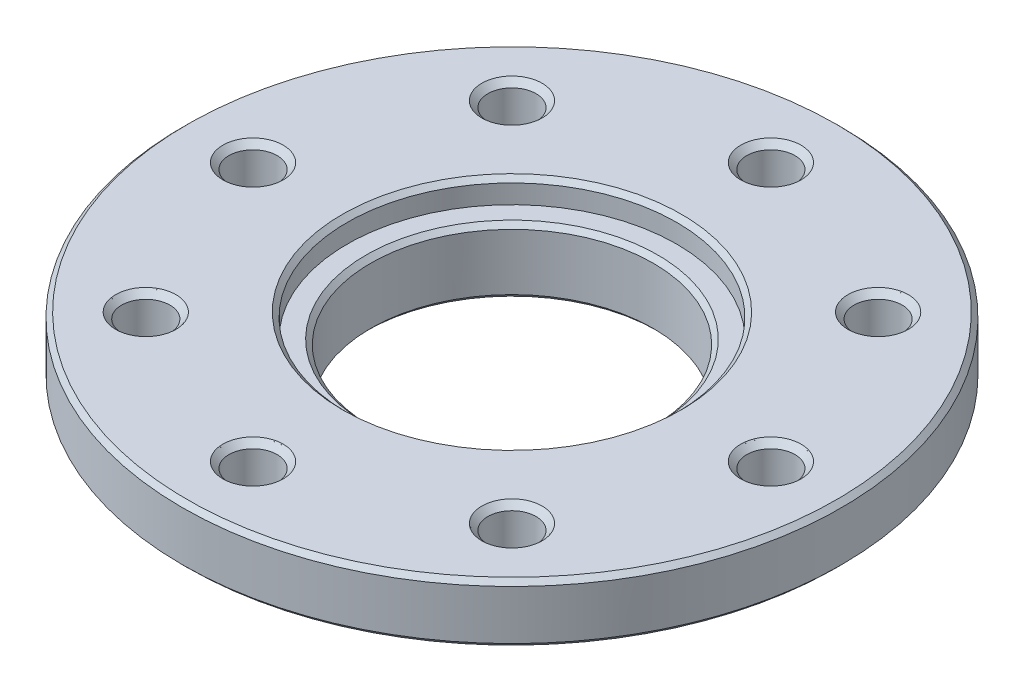
ISO-10303-21;
HEADER;
FILE_DESCRIPTION(('STEP AP214'),'2;1');
FILE_NAME('part.step','',(''),(''),'','','');
FILE_SCHEMA(('AUTOMOTIVE_DESIGN { 1 0 10303 214 1 1 1 1 }'));
ENDSEC;
DATA;
#1=APPLICATION_CONTEXT('core data for automotive mechanical design processes');
#2=APPLICATION_PROTOCOL_DEFINITION('international standard','automotive_design',2000,#1);
#3=PRODUCT_CONTEXT('',#1,'mechanical');
#4=PRODUCT('Part','Part','',(#3));
#5=PRODUCT_RELATED_PRODUCT_CATEGORY('part','',(#4));
#6=PRODUCT_DEFINITION_FORMATION('','',#4);
#7=PRODUCT_DEFINITION_CONTEXT('part definition',#1,'design');
#8=PRODUCT_DEFINITION('design','',#6,#7);
#9=PRODUCT_DEFINITION_SHAPE('','',#8);
#10=(LENGTH_UNIT() NAMED_UNIT(*) SI_UNIT(.MILLI.,.METRE.));
#11=(NAMED_UNIT(*) PLANE_ANGLE_UNIT() SI_UNIT($,.RADIAN.));
#12=(NAMED_UNIT(*) SI_UNIT($,.STERADIAN.) SOLID_ANGLE_UNIT());
#13=UNCERTAINTY_MEASURE_WITH_UNIT(LENGTH_MEASURE(1.E-05),#10,'distance_accuracy_value','');
#14=(GEOMETRIC_REPRESENTATION_CONTEXT(3) GLOBAL_UNCERTAINTY_ASSIGNED_CONTEXT((#13)) GLOBAL_UNIT_ASSIGNED_CONTEXT((#10,
#11,#12)) REPRESENTATION_CONTEXT('',''));
#15=CARTESIAN_POINT('',(0.,0.,0.));
#16=DIRECTION('',(0.,0.,1.));
#17=DIRECTION('',(1.,0.,0.));
#18=AXIS2_PLACEMENT_3D('',#15,#16,#17);
#19=CARTESIAN_POINT('',(7.778174593052,-4.389,7.778174593052));
#20=DIRECTION('',(0.,1.,0.));
#21=DIRECTION('',(0.,0.,1.));
#22=AXIS2_PLACEMENT_3D('',#19,#20,#21);
#23=CYLINDRICAL_SURFACE('',#22,1.25);
#24=CARTESIAN_POINT('',(7.778174593052,-0.03125,7.778174593052));
#25=DIRECTION('',(0.,1.,0.));
#26=DIRECTION('',(0.,0.,1.));
#27=AXIS2_PLACEMENT_3D('',#24,#25,#26);
#28=CIRCLE('',#27,1.25);
#29=CARTESIAN_POINT('',(7.778174593052,-0.03125,9.028174593052));
#30=VERTEX_POINT('',#29);
#31=EDGE_CURVE('P0_E10',#30,#30,#28,.F.);
#32=ORIENTED_EDGE('',*,*,#31,.T.);
#33=EDGE_LOOP('',(#32));
#34=FACE_BOUND('',#33,.T.);
#35=CARTESIAN_POINT('',(7.778174593052,-2.5,7.778174593052));
#36=DIRECTION('',(0.,1.,0.));
#37=DIRECTION('',(0.,0.,1.));
#38=AXIS2_PLACEMENT_3D('',#35,#36,#37);
#39=CIRCLE('',#38,1.25);
#40=CARTESIAN_POINT('',(7.778174593052,-2.5,9.028174593052));
#41=VERTEX_POINT('',#40);
#42=EDGE_CURVE('P0_E16',#41,#41,#39,.T.);
#43=ORIENTED_EDGE('',*,*,#42,.T.);
#44=EDGE_LOOP('',(#43));
#45=FACE_BOUND('',#44,.T.);
#46=ADVANCED_FACE('P0_F15',(#34,#45),#23,.T.);
#47=OPEN_SHELL('',(#46));
#48=SHELL_BASED_SURFACE_MODEL('P0_B1',(#47));
#49=CARTESIAN_POINT('',(0.,-1.00000000009004,0.));
#50=DIRECTION('',(0.,1.,0.));
#51=DIRECTION('',(0.,0.,1.));
#52=AXIS2_PLACEMENT_3D('',#49,#50,#51);
#53=CONICAL_SURFACE('',#52,6.1999999999216,0.785398163397448);
#54=CARTESIAN_POINT('',(0.,-0.999999999976353,0.));
#55=DIRECTION('',(0.,1.,0.));
#56=DIRECTION('',(0.,0.,1.));
#57=AXIS2_PLACEMENT_3D('',#54,#55,#56);
#58=CIRCLE('',#57,6.20000000003529);
#59=CARTESIAN_POINT('',(0.,-0.999999999976353,6.20000000003529));
#60=VERTEX_POINT('',#59);
#61=EDGE_CURVE('P1_E18',#60,#60,#58,.T.);
#62=ORIENTED_EDGE('',*,*,#61,.T.);
#63=EDGE_LOOP('',(#62));
#64=FACE_BOUND('',#63,.T.);
#65=CARTESIAN_POINT('',(0.,-1.2,0.));
#66=DIRECTION('',(0.,-1.,0.));
#67=DIRECTION('',(0.,0.,-1.));
#68=AXIS2_PLACEMENT_3D('',#65,#66,#67);
#69=CIRCLE('',#68,6.);
#70=CARTESIAN_POINT('',(0.,-1.2,-6.));
#71=VERTEX_POINT('',#70);
#72=EDGE_CURVE('P1_E30',#71,#71,#69,.T.);
#73=ORIENTED_EDGE('',*,*,#72,.T.);
#74=EDGE_LOOP('',(#73));
#75=FACE_BOUND('',#74,.T.);
#76=ADVANCED_FACE('P1_F15',(#64,#75),#53,.F.);
#77=CARTESIAN_POINT('',(0.,-1.,0.));
#78=DIRECTION('',(0.,-1.,0.));
#79=DIRECTION('',(0.,0.,-1.));
#80=AXIS2_PLACEMENT_3D('',#77,#78,#79);
#81=PLANE('',#80);
#82=ORIENTED_EDGE('',*,*,#61,.F.);
#83=EDGE_LOOP('',(#82));
#84=FACE_BOUND('',#83,.T.);
#85=CARTESIAN_POINT('',(0.,-1.,0.));
#86=DIRECTION('',(0.,-1.,0.));
#87=DIRECTION('',(0.,0.,-1.));
#88=AXIS2_PLACEMENT_3D('',#85,#86,#87);
#89=CIRCLE('',#88,7.);
#90=CARTESIAN_POINT('',(0.,-1.,-7.));
#91=VERTEX_POINT('',#90);
#92=EDGE_CURVE('P1_E95',#91,#91,#89,.F.);
#93=ORIENTED_EDGE('',*,*,#92,.T.);
#94=EDGE_LOOP('',(#93));
#95=FACE_BOUND('',#94,.T.);
#96=ADVANCED_FACE('P1_F108',(#84,#95),#81,.F.);
#97=CARTESIAN_POINT('',(0.,0.19,0.));
#98=DIRECTION('',(0.,-1.,0.));
#99=DIRECTION('',(0.,0.,-1.));
#100=AXIS2_PLACEMENT_3D('',#97,#98,#99);
#101=CYLINDRICAL_SURFACE('',#100,6.);
#102=CARTESIAN_POINT('',(0.,-3.59999999994898,0.));
#103=DIRECTION('',(0.,-1.,0.));
#104=DIRECTION('',(-1.,0.,0.));
#105=AXIS2_PLACEMENT_3D('',#102,#103,#104);
#106=CIRCLE('',#105,5.99999999997181);
#107=CARTESIAN_POINT('',(-5.99999999997181,-3.59999999994898,0.));
#108=VERTEX_POINT('',#107);
#109=EDGE_CURVE('P1_E97',#108,#108,#106,.T.);
#110=ORIENTED_EDGE('',*,*,#109,.T.);
#111=EDGE_LOOP('',(#110));
#112=FACE_BOUND('',#111,.T.);
#113=ORIENTED_EDGE('',*,*,#72,.F.);
#114=EDGE_LOOP('',(#113));
#115=FACE_BOUND('',#114,.T.);
#116=ADVANCED_FACE('P1_F110',(#112,#115),#101,.F.);
#117=CARTESIAN_POINT('',(0.,0.19,0.));
#118=DIRECTION('',(0.,-1.,0.));
#119=DIRECTION('',(0.,0.,-1.));
#120=AXIS2_PLACEMENT_3D('',#117,#118,#119);
#121=CYLINDRICAL_SURFACE('',#120,7.);
#122=ORIENTED_EDGE('',*,*,#92,.F.);
#123=EDGE_LOOP('',(#122));
#124=FACE_BOUND('',#123,.T.);
#125=CARTESIAN_POINT('',(0.,-0.200000000000014,0.));
#126=DIRECTION('',(0.,1.,0.));
#127=DIRECTION('',(1.,0.,0.));
#128=AXIS2_PLACEMENT_3D('',#125,#126,#127);
#129=CIRCLE('',#128,7.00000000000002);
#130=CARTESIAN_POINT('',(7.00000000000002,-0.200000000000014,0.));
#131=VERTEX_POINT('',#130);
#132=EDGE_CURVE('P1_E94',#131,#131,#129,.T.);
#133=ORIENTED_EDGE('',*,*,#132,.T.);
#134=EDGE_LOOP('',(#133));
#135=FACE_BOUND('',#134,.T.);
#136=ADVANCED_FACE('P1_F116',(#124,#135),#121,.F.);
#137=CARTESIAN_POINT('',(0.,-3.79999999989877,0.));
#138=DIRECTION('',(0.,-1.,0.));
#139=DIRECTION('',(0.,0.,-1.));
#140=AXIS2_PLACEMENT_3D('',#137,#138,#139);
#141=CONICAL_SURFACE('',#140,6.1999999999216,0.785398163397448);
#142=ORIENTED_EDGE('',*,*,#109,.F.);
#143=EDGE_LOOP('',(#142));
#144=FACE_BOUND('',#143,.T.);
#145=CARTESIAN_POINT('',(0.,-3.80000000001246,0.));
#146=DIRECTION('',(0.,-1.,0.));
#147=DIRECTION('',(0.,0.,-1.));
#148=AXIS2_PLACEMENT_3D('',#145,#146,#147);
#149=CIRCLE('',#148,6.20000000003529);
#150=CARTESIAN_POINT('',(0.,-3.80000000001246,-6.20000000003529));
#151=VERTEX_POINT('',#150);
#152=EDGE_CURVE('P1_E92',#151,#151,#149,.F.);
#153=ORIENTED_EDGE('',*,*,#152,.F.);
#154=EDGE_LOOP('',(#153));
#155=FACE_BOUND('',#154,.T.);
#156=ADVANCED_FACE('P1_F221',(#144,#155),#141,.F.);
#157=CARTESIAN_POINT('',(0.,0.,0.));
#158=DIRECTION('',(0.,1.,0.));
#159=DIRECTION('',(0.,0.,1.));
#160=AXIS2_PLACEMENT_3D('',#157,#158,#159);
#161=CONICAL_SURFACE('',#160,7.19999999999999,0.7853981633973);
#162=CARTESIAN_POINT('',(0.,0.,0.));
#163=DIRECTION('',(0.,1.,0.));
#164=DIRECTION('',(0.,0.,1.));
#165=AXIS2_PLACEMENT_3D('',#162,#163,#164);
#166=CIRCLE('',#165,7.19999999999999);
#167=CARTESIAN_POINT('',(0.,0.,7.19999999999999));
#168=VERTEX_POINT('',#167);
#169=EDGE_CURVE('P1_E86',#168,#168,#166,.T.);
#170=ORIENTED_EDGE('',*,*,#169,.T.);
#171=EDGE_LOOP('',(#170));
#172=FACE_BOUND('',#171,.T.);
#173=ORIENTED_EDGE('',*,*,#132,.F.);
#174=EDGE_LOOP('',(#173));
#175=FACE_BOUND('',#174,.T.);
#176=ADVANCED_FACE('P1_F217',(#172,#175),#161,.F.);
#177=CARTESIAN_POINT('',(0.,-0.200000000000015,0.));
#178=DIRECTION('',(0.,-1.,0.));
#179=DIRECTION('',(0.,0.,-1.));
#180=AXIS2_PLACEMENT_3D('',#177,#178,#179);
#181=CONICAL_SURFACE('',#180,14.,0.7853981633973);
#182=CARTESIAN_POINT('',(0.,-0.2,0.));
#183=DIRECTION('',(0.,-1.,0.));
#184=DIRECTION('',(0.,0.,-1.));
#185=AXIS2_PLACEMENT_3D('',#182,#183,#184);
#186=CIRCLE('',#185,14.);
#187=CARTESIAN_POINT('',(0.,-0.2,-14.));
#188=VERTEX_POINT('',#187);
#189=EDGE_CURVE('P1_E85',#188,#188,#186,.T.);
#190=ORIENTED_EDGE('',*,*,#189,.F.);
#191=EDGE_LOOP('',(#190));
#192=FACE_BOUND('',#191,.T.);
#193=CARTESIAN_POINT('',(0.,0.,0.));
#194=DIRECTION('',(0.,-1.,0.));
#195=DIRECTION('',(0.,0.,-1.));
#196=AXIS2_PLACEMENT_3D('',#193,#194,#195);
#197=CIRCLE('',#196,13.8);
#198=CARTESIAN_POINT('',(0.,0.,-13.8));
#199=VERTEX_POINT('',#198);
#200=EDGE_CURVE('P1_E89',#199,#199,#197,.T.);
#201=ORIENTED_EDGE('',*,*,#200,.T.);
#202=EDGE_LOOP('',(#201));
#203=FACE_BOUND('',#202,.T.);
#204=ADVANCED_FACE('P1_F213',(#192,#203),#181,.T.);
#205=CARTESIAN_POINT('',(0.,-3.8,0.));
#206=DIRECTION('',(0.,-1.,0.));
#207=DIRECTION('',(0.,0.,-1.));
#208=AXIS2_PLACEMENT_3D('',#205,#206,#207);
#209=PLANE('',#208);
#210=ORIENTED_EDGE('',*,*,#152,.T.);
#211=EDGE_LOOP('',(#210));
#212=FACE_BOUND('',#211,.T.);
#213=CARTESIAN_POINT('',(0.,-3.80000000000002,0.));
#214=DIRECTION('',(0.,1.,0.));
#215=DIRECTION('',(0.,0.,1.));
#216=AXIS2_PLACEMENT_3D('',#213,#214,#215);
#217=CIRCLE('',#216,7.05000000000001);
#218=CARTESIAN_POINT('',(0.,-3.80000000000002,7.05000000000001));
#219=VERTEX_POINT('',#218);
#220=EDGE_CURVE('P1_E82',#219,#219,#217,.T.);
#221=ORIENTED_EDGE('',*,*,#220,.F.);
#222=EDGE_LOOP('',(#221));
#223=FACE_BOUND('',#222,.T.);
#224=ADVANCED_FACE('P1_F209',(#212,#223),#209,.T.);
#225=CARTESIAN_POINT('',(0.,0.,0.));
#226=DIRECTION('',(0.,-1.,0.));
#227=DIRECTION('',(0.,0.,-1.));
#228=AXIS2_PLACEMENT_3D('',#225,#226,#227);
#229=PLANE('',#228);
#230=CARTESIAN_POINT('',(-7.778174593052,0.,-7.778174593052));
#231=DIRECTION('',(0.,1.,0.));
#232=DIRECTION('',(0.,0.,1.));
#233=AXIS2_PLACEMENT_3D('',#230,#231,#232);
#234=CIRCLE('',#233,1.28125000002913);
#235=CARTESIAN_POINT('',(-7.778174593052,0.,-6.49692459302287));
#236=VERTEX_POINT('',#235);
#237=EDGE_CURVE('P1_E57',#236,#236,#234,.F.);
#238=ORIENTED_EDGE('',*,*,#237,.T.);
#239=EDGE_LOOP('',(#238));
#240=FACE_BOUND('',#239,.T.);
#241=CARTESIAN_POINT('',(-11.,0.,0.));
#242=DIRECTION('',(0.,1.,0.));
#243=DIRECTION('',(0.,0.,1.));
#244=AXIS2_PLACEMENT_3D('',#241,#242,#243);
#245=CIRCLE('',#244,1.28125000000955);
#246=CARTESIAN_POINT('',(-11.,0.,1.28125000000955));
#247=VERTEX_POINT('',#246);
#248=EDGE_CURVE('P1_E61',#247,#247,#245,.F.);
#249=ORIENTED_EDGE('',*,*,#248,.T.);
#250=EDGE_LOOP('',(#249));
#251=FACE_BOUND('',#250,.T.);
#252=CARTESIAN_POINT('',(-7.778174593052,0.,7.778174593052));
#253=DIRECTION('',(0.,1.,0.));
#254=DIRECTION('',(0.,0.,1.));
#255=AXIS2_PLACEMENT_3D('',#252,#253,#254);
#256=CIRCLE('',#255,1.28125000002913);
#257=CARTESIAN_POINT('',(-7.778174593052,0.,9.05942459308113));
#258=VERTEX_POINT('',#257);
#259=EDGE_CURVE('P1_E64',#258,#258,#256,.F.);
#260=ORIENTED_EDGE('',*,*,#259,.T.);
#261=EDGE_LOOP('',(#260));
#262=FACE_BOUND('',#261,.T.);
#263=CARTESIAN_POINT('',(0.,0.,11.));
#264=DIRECTION('',(0.,1.,0.));
#265=DIRECTION('',(0.,0.,1.));
#266=AXIS2_PLACEMENT_3D('',#263,#264,#265);
#267=CIRCLE('',#266,1.28124999997681);
#268=CARTESIAN_POINT('',(0.,0.,12.2812499999768));
#269=VERTEX_POINT('',#268);
#270=EDGE_CURVE('P1_E67',#269,#269,#267,.F.);
#271=ORIENTED_EDGE('',*,*,#270,.T.);
#272=EDGE_LOOP('',(#271));
#273=FACE_BOUND('',#272,.T.);
#274=CARTESIAN_POINT('',(7.778174593052,-5.6843418860808E-11,7.778174593052));
#275=DIRECTION('',(0.,1.,0.));
#276=DIRECTION('',(0.,0.,1.));
#277=AXIS2_PLACEMENT_3D('',#274,#275,#276);
#278=CIRCLE('',#277,1.28124999998133);
#279=CARTESIAN_POINT('',(7.778174593052,-5.6843418860808E-11,9.05942459303333));
#280=VERTEX_POINT('',#279);
#281=EDGE_CURVE('P1_E70',#280,#280,#278,.F.);
#282=ORIENTED_EDGE('',*,*,#281,.T.);
#283=EDGE_LOOP('',(#282));
#284=FACE_BOUND('',#283,.T.);
#285=CARTESIAN_POINT('',(11.,0.,0.));
#286=DIRECTION('',(0.,1.,0.));
#287=DIRECTION('',(0.,0.,1.));
#288=AXIS2_PLACEMENT_3D('',#285,#286,#287);
#289=CIRCLE('',#288,1.28125000005775);
#290=CARTESIAN_POINT('',(11.,0.,1.28125000005775));
#291=VERTEX_POINT('',#290);
#292=EDGE_CURVE('P1_E73',#291,#291,#289,.F.);
#293=ORIENTED_EDGE('',*,*,#292,.T.);
#294=EDGE_LOOP('',(#293));
#295=FACE_BOUND('',#294,.T.);
#296=CARTESIAN_POINT('',(7.778174593052,-5.6843418860808E-11,-7.778174593052));
#297=DIRECTION('',(0.,1.,0.));
#298=DIRECTION('',(0.,0.,1.));
#299=AXIS2_PLACEMENT_3D('',#296,#297,#298);
#300=CIRCLE('',#299,1.28124999998133);
#301=CARTESIAN_POINT('',(7.778174593052,-5.6843418860808E-11,-6.49692459307067));
#302=VERTEX_POINT('',#301);
#303=EDGE_CURVE('P1_E76',#302,#302,#300,.F.);
#304=ORIENTED_EDGE('',*,*,#303,.T.);
#305=EDGE_LOOP('',(#304));
#306=FACE_BOUND('',#305,.T.);
#307=CARTESIAN_POINT('',(0.,0.,-11.));
#308=DIRECTION('',(0.,1.,0.));
#309=DIRECTION('',(0.,0.,1.));
#310=AXIS2_PLACEMENT_3D('',#307,#308,#309);
#311=CIRCLE('',#310,1.28124999997681);
#312=CARTESIAN_POINT('',(0.,0.,-9.71875000002319));
#313=VERTEX_POINT('',#312);
#314=EDGE_CURVE('P1_E79',#313,#313,#311,.F.);
#315=ORIENTED_EDGE('',*,*,#314,.T.);
#316=EDGE_LOOP('',(#315));
#317=FACE_BOUND('',#316,.T.);
#318=ORIENTED_EDGE('',*,*,#169,.F.);
#319=EDGE_LOOP('',(#318));
#320=FACE_BOUND('',#319,.T.);
#321=ORIENTED_EDGE('',*,*,#200,.F.);
#322=EDGE_LOOP('',(#321));
#323=FACE_BOUND('',#322,.T.);
#324=ADVANCED_FACE('P1_F205',(#240,#251,#262,#273,#284,#295,#306,#317,#320,#323),#229,.F.);
#325=CARTESIAN_POINT('',(0.,0.19,0.));
#326=DIRECTION('',(0.,-1.,0.));
#327=DIRECTION('',(0.,0.,-1.));
#328=AXIS2_PLACEMENT_3D('',#325,#326,#327);
#329=CYLINDRICAL_SURFACE('',#328,14.);
#330=CARTESIAN_POINT('',(0.,-2.29999999999999,0.));
#331=DIRECTION('',(0.,1.,0.));
#332=DIRECTION('',(1.,0.,0.));
#333=AXIS2_PLACEMENT_3D('',#330,#331,#332);
#334=CIRCLE('',#333,14.);
#335=CARTESIAN_POINT('',(14.,-2.29999999999999,0.));
#336=VERTEX_POINT('',#335);
#337=EDGE_CURVE('P1_E60',#336,#336,#334,.F.);
#338=ORIENTED_EDGE('',*,*,#337,.F.);
#339=EDGE_LOOP('',(#338));
#340=FACE_BOUND('',#339,.T.);
#341=ORIENTED_EDGE('',*,*,#189,.T.);
#342=EDGE_LOOP('',(#341));
#343=FACE_BOUND('',#342,.T.);
#344=ADVANCED_FACE('P1_F201',(#340,#343),#329,.T.);
#345=CARTESIAN_POINT('',(0.,-3.59999999999998,0.));
#346=DIRECTION('',(0.,1.,0.));
#347=DIRECTION('',(0.,0.,1.));
#348=AXIS2_PLACEMENT_3D('',#345,#346,#347);
#349=CONICAL_SURFACE('',#348,7.24999999999999,0.785398163397301);
#350=ORIENTED_EDGE('',*,*,#220,.T.);
#351=EDGE_LOOP('',(#350));
#352=FACE_BOUND('',#351,.T.);
#353=CARTESIAN_POINT('',(0.,-3.6,0.));
#354=DIRECTION('',(0.,-1.,0.));
#355=DIRECTION('',(0.,0.,-1.));
#356=AXIS2_PLACEMENT_3D('',#353,#354,#355);
#357=CIRCLE('',#356,7.25);
#358=CARTESIAN_POINT('',(0.,-3.6,-7.25));
#359=VERTEX_POINT('',#358);
#360=EDGE_CURVE('P1_E240',#359,#359,#357,.F.);
#361=ORIENTED_EDGE('',*,*,#360,.F.);
#362=EDGE_LOOP('',(#361));
#363=FACE_BOUND('',#362,.T.);
#364=ADVANCED_FACE('P1_F197',(#352,#363),#349,.T.);
#365=CARTESIAN_POINT('',(0.,-1.13686837721616E-10,-11.));
#366=DIRECTION('',(0.,1.,0.));
#367=DIRECTION('',(0.,0.,1.));
#368=AXIS2_PLACEMENT_3D('',#365,#366,#367);
#369=CONICAL_SURFACE('',#368,1.28124999986312,0.785398163397448);
#370=CARTESIAN_POINT('',(0.,-0.25625,-11.));
#371=DIRECTION('',(0.,1.,0.));
#372=DIRECTION('',(0.,0.,1.));
#373=AXIS2_PLACEMENT_3D('',#370,#371,#372);
#374=CIRCLE('',#373,1.025);
#375=CARTESIAN_POINT('',(0.,-0.25625,-9.975));
#376=VERTEX_POINT('',#375);
#377=EDGE_CURVE('P1_E243',#376,#376,#374,.F.);
#378=ORIENTED_EDGE('',*,*,#377,.T.);
#379=EDGE_LOOP('',(#378));
#380=FACE_BOUND('',#379,.T.);
#381=ORIENTED_EDGE('',*,*,#314,.F.);
#382=EDGE_LOOP('',(#381));
#383=FACE_BOUND('',#382,.T.);
#384=ADVANCED_FACE('P1_F193',(#380,#383),#369,.F.);
#385=CARTESIAN_POINT('',(7.778174593052,-5.6843418860808E-11,-7.778174593052));
#386=DIRECTION('',(0.,1.,0.));
#387=DIRECTION('',(0.,0.,1.));
#388=AXIS2_PLACEMENT_3D('',#385,#386,#387);
#389=CONICAL_SURFACE('',#388,1.28124999998133,0.785398163397448);
#390=CARTESIAN_POINT('',(7.778174593052,-0.25625,-7.778174593052));
#391=DIRECTION('',(0.,1.,0.));
#392=DIRECTION('',(0.,0.,1.));
#393=AXIS2_PLACEMENT_3D('',#390,#391,#392);
#394=CIRCLE('',#393,1.025);
#395=CARTESIAN_POINT('',(7.778174593052,-0.25625,-6.753174593052));
#396=VERTEX_POINT('',#395);
#397=EDGE_CURVE('P1_E246',#396,#396,#394,.F.);
#398=ORIENTED_EDGE('',*,*,#397,.T.);
#399=EDGE_LOOP('',(#398));
#400=FACE_BOUND('',#399,.T.);
#401=ORIENTED_EDGE('',*,*,#303,.F.);
#402=EDGE_LOOP('',(#401));
#403=FACE_BOUND('',#402,.T.);
#404=ADVANCED_FACE('P1_F189',(#400,#403),#389,.F.);
#405=CARTESIAN_POINT('',(11.,0.,0.));
#406=DIRECTION('',(0.,1.,0.));
#407=DIRECTION('',(0.,0.,1.));
#408=AXIS2_PLACEMENT_3D('',#405,#406,#407);
#409=CONICAL_SURFACE('',#408,1.28125000005775,0.785398163397448);
#410=CARTESIAN_POINT('',(11.,-0.25625,0.));
#411=DIRECTION('',(0.,1.,0.));
#412=DIRECTION('',(0.,0.,1.));
#413=AXIS2_PLACEMENT_3D('',#410,#411,#412);
#414=CIRCLE('',#413,1.025);
#415=CARTESIAN_POINT('',(11.,-0.25625,1.025));
#416=VERTEX_POINT('',#415);
#417=EDGE_CURVE('P1_E249',#416,#416,#414,.F.);
#418=ORIENTED_EDGE('',*,*,#417,.T.);
#419=EDGE_LOOP('',(#418));
#420=FACE_BOUND('',#419,.T.);
#421=ORIENTED_EDGE('',*,*,#292,.F.);
#422=EDGE_LOOP('',(#421));
#423=FACE_BOUND('',#422,.T.);
#424=ADVANCED_FACE('P1_F185',(#420,#423),#409,.F.);
#425=CARTESIAN_POINT('',(7.778174593052,-5.6843418860808E-11,7.778174593052));
#426=DIRECTION('',(0.,1.,0.));
#427=DIRECTION('',(0.,0.,1.));
#428=AXIS2_PLACEMENT_3D('',#425,#426,#427);
#429=CONICAL_SURFACE('',#428,1.28124999998133,0.785398163397448);
#430=CARTESIAN_POINT('',(7.778174593052,-0.25625,7.778174593052));
#431=DIRECTION('',(0.,1.,0.));
#432=DIRECTION('',(0.,0.,1.));
#433=AXIS2_PLACEMENT_3D('',#430,#431,#432);
#434=CIRCLE('',#433,1.025);
#435=CARTESIAN_POINT('',(7.778174593052,-0.25625,8.803174593052));
#436=VERTEX_POINT('',#435);
#437=EDGE_CURVE('P1_E252',#436,#436,#434,.F.);
#438=ORIENTED_EDGE('',*,*,#437,.T.);
#439=EDGE_LOOP('',(#438));
#440=FACE_BOUND('',#439,.T.);
#441=ORIENTED_EDGE('',*,*,#281,.F.);
#442=EDGE_LOOP('',(#441));
#443=FACE_BOUND('',#442,.T.);
#444=ADVANCED_FACE('P1_F181',(#440,#443),#429,.F.);
#445=CARTESIAN_POINT('',(0.,-1.13686837721616E-10,11.));
#446=DIRECTION('',(0.,1.,0.));
#447=DIRECTION('',(0.,0.,1.));
#448=AXIS2_PLACEMENT_3D('',#445,#446,#447);
#449=CONICAL_SURFACE('',#448,1.28124999986312,0.785398163397448);
#450=CARTESIAN_POINT('',(0.,-0.25625,11.));
#451=DIRECTION('',(0.,1.,0.));
#452=DIRECTION('',(0.,0.,1.));
#453=AXIS2_PLACEMENT_3D('',#450,#451,#452);
#454=CIRCLE('',#453,1.025);
#455=CARTESIAN_POINT('',(0.,-0.25625,12.025));
#456=VERTEX_POINT('',#455);
#457=EDGE_CURVE('P1_E255',#456,#456,#454,.F.);
#458=ORIENTED_EDGE('',*,*,#457,.T.);
#459=EDGE_LOOP('',(#458));
#460=FACE_BOUND('',#459,.T.);
#461=ORIENTED_EDGE('',*,*,#270,.F.);
#462=EDGE_LOOP('',(#461));
#463=FACE_BOUND('',#462,.T.);
#464=ADVANCED_FACE('P1_F177',(#460,#463),#449,.F.);
#465=CARTESIAN_POINT('',(-7.778174593052,0.,7.778174593052));
#466=DIRECTION('',(0.,1.,0.));
#467=DIRECTION('',(0.,0.,1.));
#468=AXIS2_PLACEMENT_3D('',#465,#466,#467);
#469=CONICAL_SURFACE('',#468,1.28125000002913,0.785398163397448);
#470=CARTESIAN_POINT('',(-7.778174593052,-0.25625,7.778174593052));
#471=DIRECTION('',(0.,1.,0.));
#472=DIRECTION('',(0.,0.,1.));
#473=AXIS2_PLACEMENT_3D('',#470,#471,#472);
#474=CIRCLE('',#473,1.025);
#475=CARTESIAN_POINT('',(-7.778174593052,-0.25625,8.803174593052));
#476=VERTEX_POINT('',#475);
#477=EDGE_CURVE('P1_E258',#476,#476,#474,.F.);
#478=ORIENTED_EDGE('',*,*,#477,.T.);
#479=EDGE_LOOP('',(#478));
#480=FACE_BOUND('',#479,.T.);
#481=ORIENTED_EDGE('',*,*,#259,.F.);
#482=EDGE_LOOP('',(#481));
#483=FACE_BOUND('',#482,.T.);
#484=ADVANCED_FACE('P1_F173',(#480,#483),#469,.F.);
#485=CARTESIAN_POINT('',(-11.,0.,0.));
#486=DIRECTION('',(0.,1.,0.));
#487=DIRECTION('',(0.,0.,1.));
#488=AXIS2_PLACEMENT_3D('',#485,#486,#487);
#489=CONICAL_SURFACE('',#488,1.28125000000955,0.785398163397448);
#490=CARTESIAN_POINT('',(-11.,-0.25625,0.));
#491=DIRECTION('',(0.,1.,0.));
#492=DIRECTION('',(0.,0.,1.));
#493=AXIS2_PLACEMENT_3D('',#490,#491,#492);
#494=CIRCLE('',#493,1.025);
#495=CARTESIAN_POINT('',(-11.,-0.25625,1.025));
#496=VERTEX_POINT('',#495);
#497=EDGE_CURVE('P1_E261',#496,#496,#494,.F.);
#498=ORIENTED_EDGE('',*,*,#497,.T.);
#499=EDGE_LOOP('',(#498));
#500=FACE_BOUND('',#499,.T.);
#501=ORIENTED_EDGE('',*,*,#248,.F.);
#502=EDGE_LOOP('',(#501));
#503=FACE_BOUND('',#502,.T.);
#504=ADVANCED_FACE('P1_F169',(#500,#503),#489,.F.);
#505=CARTESIAN_POINT('',(-7.778174593052,0.,-7.778174593052));
#506=DIRECTION('',(0.,1.,0.));
#507=DIRECTION('',(0.,0.,1.));
#508=AXIS2_PLACEMENT_3D('',#505,#506,#507);
#509=CONICAL_SURFACE('',#508,1.28125000002913,0.785398163397448);
#510=CARTESIAN_POINT('',(-7.778174593052,-0.25625,-7.778174593052));
#511=DIRECTION('',(0.,1.,0.));
#512=DIRECTION('',(0.,0.,1.));
#513=AXIS2_PLACEMENT_3D('',#510,#511,#512);
#514=CIRCLE('',#513,1.025);
#515=CARTESIAN_POINT('',(-7.778174593052,-0.25625,-6.753174593052));
#516=VERTEX_POINT('',#515);
#517=EDGE_CURVE('P1_E56',#516,#516,#514,.F.);
#518=ORIENTED_EDGE('',*,*,#517,.T.);
#519=EDGE_LOOP('',(#518));
#520=FACE_BOUND('',#519,.T.);
#521=ORIENTED_EDGE('',*,*,#237,.F.);
#522=EDGE_LOOP('',(#521));
#523=FACE_BOUND('',#522,.T.);
#524=ADVANCED_FACE('P1_F165',(#520,#523),#509,.F.);
#525=CARTESIAN_POINT('',(0.,-2.29999999999998,0.));
#526=DIRECTION('',(0.,1.,0.));
#527=DIRECTION('',(0.,0.,1.));
#528=AXIS2_PLACEMENT_3D('',#525,#526,#527);
#529=CONICAL_SURFACE('',#528,14.,0.785398163397301);
#530=CARTESIAN_POINT('',(0.,-2.50000000000001,0.));
#531=DIRECTION('',(0.,1.,0.));
#532=DIRECTION('',(0.,0.,1.));
#533=AXIS2_PLACEMENT_3D('',#530,#531,#532);
#534=CIRCLE('',#533,13.8);
#535=CARTESIAN_POINT('',(0.,-2.50000000000001,13.8));
#536=VERTEX_POINT('',#535);
#537=EDGE_CURVE('P1_E53',#536,#536,#534,.F.);
#538=ORIENTED_EDGE('',*,*,#537,.F.);
#539=EDGE_LOOP('',(#538));
#540=FACE_BOUND('',#539,.T.);
#541=ORIENTED_EDGE('',*,*,#337,.T.);
#542=EDGE_LOOP('',(#541));
#543=FACE_BOUND('',#542,.T.);
#544=ADVANCED_FACE('P1_F161',(#540,#543),#529,.T.);
#545=CARTESIAN_POINT('',(0.,0.19,0.));
#546=DIRECTION('',(0.,-1.,0.));
#547=DIRECTION('',(0.,0.,-1.));
#548=AXIS2_PLACEMENT_3D('',#545,#546,#547);
#549=CYLINDRICAL_SURFACE('',#548,7.25);
#550=CARTESIAN_POINT('',(0.,-2.5,0.));
#551=DIRECTION('',(0.,-1.,0.));
#552=DIRECTION('',(0.,0.,-1.));
#553=AXIS2_PLACEMENT_3D('',#550,#551,#552);
#554=CIRCLE('',#553,7.25);
#555=CARTESIAN_POINT('',(0.,-2.5,-7.25));
#556=VERTEX_POINT('',#555);
#557=EDGE_CURVE('P1_E50',#556,#556,#554,.F.);
#558=ORIENTED_EDGE('',*,*,#557,.F.);
#559=EDGE_LOOP('',(#558));
#560=FACE_BOUND('',#559,.T.);
#561=ORIENTED_EDGE('',*,*,#360,.T.);
#562=EDGE_LOOP('',(#561));
#563=FACE_BOUND('',#562,.T.);
#564=ADVANCED_FACE('P1_F157',(#560,#563),#549,.T.);
#565=CARTESIAN_POINT('',(0.,-4.389,-11.));
#566=DIRECTION('',(0.,1.,0.));
#567=DIRECTION('',(0.,0.,1.));
#568=AXIS2_PLACEMENT_3D('',#565,#566,#567);
#569=CYLINDRICAL_SURFACE('',#568,1.025);
#570=ORIENTED_EDGE('',*,*,#377,.F.);
#571=EDGE_LOOP('',(#570));
#572=FACE_BOUND('',#571,.T.);
#573=CARTESIAN_POINT('',(0.,-2.5,-11.));
#574=DIRECTION('',(0.,1.,0.));
#575=DIRECTION('',(0.,0.,1.));
#576=AXIS2_PLACEMENT_3D('',#573,#574,#575);
#577=CIRCLE('',#576,1.025);
#578=CARTESIAN_POINT('',(0.,-2.5,-9.975));
#579=VERTEX_POINT('',#578);
#580=EDGE_CURVE('P1_E47',#579,#579,#577,.T.);
#581=ORIENTED_EDGE('',*,*,#580,.F.);
#582=EDGE_LOOP('',(#581));
#583=FACE_BOUND('',#582,.T.);
#584=ADVANCED_FACE('P1_F153',(#572,#583),#569,.F.);
#585=CARTESIAN_POINT('',(7.778174593052,-4.389,-7.778174593052));
#586=DIRECTION('',(0.,1.,0.));
#587=DIRECTION('',(0.,0.,1.));
#588=AXIS2_PLACEMENT_3D('',#585,#586,#587);
#589=CYLINDRICAL_SURFACE('',#588,1.025);
#590=ORIENTED_EDGE('',*,*,#397,.F.);
#591=EDGE_LOOP('',(#590));
#592=FACE_BOUND('',#591,.T.);
#593=CARTESIAN_POINT('',(7.778174593052,-2.5,-7.778174593052));
#594=DIRECTION('',(0.,1.,0.));
#595=DIRECTION('',(0.,0.,1.));
#596=AXIS2_PLACEMENT_3D('',#593,#594,#595);
#597=CIRCLE('',#596,1.025);
#598=CARTESIAN_POINT('',(7.778174593052,-2.5,-6.753174593052));
#599=VERTEX_POINT('',#598);
#600=EDGE_CURVE('P1_E44',#599,#599,#597,.T.);
#601=ORIENTED_EDGE('',*,*,#600,.F.);
#602=EDGE_LOOP('',(#601));
#603=FACE_BOUND('',#602,.T.);
#604=ADVANCED_FACE('P1_F149',(#592,#603),#589,.F.);
#605=CARTESIAN_POINT('',(11.,-4.389,0.));
#606=DIRECTION('',(0.,1.,0.));
#607=DIRECTION('',(0.,0.,1.));
#608=AXIS2_PLACEMENT_3D('',#605,#606,#607);
#609=CYLINDRICAL_SURFACE('',#608,1.025);
#610=ORIENTED_EDGE('',*,*,#417,.F.);
#611=EDGE_LOOP('',(#610));
#612=FACE_BOUND('',#611,.T.);
#613=CARTESIAN_POINT('',(11.,-2.5,0.));
#614=DIRECTION('',(0.,1.,0.));
#615=DIRECTION('',(0.,0.,1.));
#616=AXIS2_PLACEMENT_3D('',#613,#614,#615);
#617=CIRCLE('',#616,1.025);
#618=CARTESIAN_POINT('',(11.,-2.5,1.025));
#619=VERTEX_POINT('',#618);
#620=EDGE_CURVE('P1_E41',#619,#619,#617,.T.);
#621=ORIENTED_EDGE('',*,*,#620,.F.);
#622=EDGE_LOOP('',(#621));
#623=FACE_BOUND('',#622,.T.);
#624=ADVANCED_FACE('P1_F145',(#612,#623),#609,.F.);
#625=CARTESIAN_POINT('',(7.778174593052,-4.389,7.778174593052));
#626=DIRECTION('',(0.,1.,0.));
#627=DIRECTION('',(0.,0.,1.));
#628=AXIS2_PLACEMENT_3D('',#625,#626,#627);
#629=CYLINDRICAL_SURFACE('',#628,1.025);
#630=ORIENTED_EDGE('',*,*,#437,.F.);
#631=EDGE_LOOP('',(#630));
#632=FACE_BOUND('',#631,.T.);
#633=CARTESIAN_POINT('',(7.778174593052,-2.5,7.778174593052));
#634=DIRECTION('',(0.,1.,0.));
#635=DIRECTION('',(0.,0.,1.));
#636=AXIS2_PLACEMENT_3D('',#633,#634,#635);
#637=CIRCLE('',#636,1.025);
#638=CARTESIAN_POINT('',(7.778174593052,-2.5,8.803174593052));
#639=VERTEX_POINT('',#638);
#640=EDGE_CURVE('P1_E38',#639,#639,#637,.T.);
#641=ORIENTED_EDGE('',*,*,#640,.F.);
#642=EDGE_LOOP('',(#641));
#643=FACE_BOUND('',#642,.T.);
#644=ADVANCED_FACE('P1_F141',(#632,#643),#629,.F.);
#645=CARTESIAN_POINT('',(0.,-4.389,11.));
#646=DIRECTION('',(0.,1.,0.));
#647=DIRECTION('',(0.,0.,1.));
#648=AXIS2_PLACEMENT_3D('',#645,#646,#647);
#649=CYLINDRICAL_SURFACE('',#648,1.025);
#650=ORIENTED_EDGE('',*,*,#457,.F.);
#651=EDGE_LOOP('',(#650));
#652=FACE_BOUND('',#651,.T.);
#653=CARTESIAN_POINT('',(0.,-2.5,11.));
#654=DIRECTION('',(0.,1.,0.));
#655=DIRECTION('',(0.,0.,1.));
#656=AXIS2_PLACEMENT_3D('',#653,#654,#655);
#657=CIRCLE('',#656,1.025);
#658=CARTESIAN_POINT('',(0.,-2.5,12.025));
#659=VERTEX_POINT('',#658);
#660=EDGE_CURVE('P1_E35',#659,#659,#657,.T.);
#661=ORIENTED_EDGE('',*,*,#660,.F.);
#662=EDGE_LOOP('',(#661));
#663=FACE_BOUND('',#662,.T.);
#664=ADVANCED_FACE('P1_F137',(#652,#663),#649,.F.);
#665=CARTESIAN_POINT('',(-7.778174593052,-4.389,7.778174593052));
#666=DIRECTION('',(0.,1.,0.));
#667=DIRECTION('',(0.,0.,1.));
#668=AXIS2_PLACEMENT_3D('',#665,#666,#667);
#669=CYLINDRICAL_SURFACE('',#668,1.025);
#670=ORIENTED_EDGE('',*,*,#477,.F.);
#671=EDGE_LOOP('',(#670));
#672=FACE_BOUND('',#671,.T.);
#673=CARTESIAN_POINT('',(-7.778174593052,-2.5,7.778174593052));
#674=DIRECTION('',(0.,1.,0.));
#675=DIRECTION('',(0.,0.,1.));
#676=AXIS2_PLACEMENT_3D('',#673,#674,#675);
#677=CIRCLE('',#676,1.025);
#678=CARTESIAN_POINT('',(-7.778174593052,-2.5,8.803174593052));
#679=VERTEX_POINT('',#678);
#680=EDGE_CURVE('P1_E27',#679,#679,#677,.T.);
#681=ORIENTED_EDGE('',*,*,#680,.F.);
#682=EDGE_LOOP('',(#681));
#683=FACE_BOUND('',#682,.T.);
#684=ADVANCED_FACE('P1_F133',(#672,#683),#669,.F.);
#685=CARTESIAN_POINT('',(-11.,-4.389,0.));
#686=DIRECTION('',(0.,1.,0.));
#687=DIRECTION('',(0.,0.,1.));
#688=AXIS2_PLACEMENT_3D('',#685,#686,#687);
#689=CYLINDRICAL_SURFACE('',#688,1.025);
#690=ORIENTED_EDGE('',*,*,#497,.F.);
#691=EDGE_LOOP('',(#690));
#692=FACE_BOUND('',#691,.T.);
#693=CARTESIAN_POINT('',(-11.,-2.5,0.));
#694=DIRECTION('',(0.,1.,0.));
#695=DIRECTION('',(0.,0.,1.));
#696=AXIS2_PLACEMENT_3D('',#693,#694,#695);
#697=CIRCLE('',#696,1.025);
#698=CARTESIAN_POINT('',(-11.,-2.5,1.025));
#699=VERTEX_POINT('',#698);
#700=EDGE_CURVE('P1_E22',#699,#699,#697,.T.);
#701=ORIENTED_EDGE('',*,*,#700,.F.);
#702=EDGE_LOOP('',(#701));
#703=FACE_BOUND('',#702,.T.);
#704=ADVANCED_FACE('P1_F126',(#692,#703),#689,.F.);
#705=CARTESIAN_POINT('',(-7.778174593052,-4.389,-7.778174593052));
#706=DIRECTION('',(0.,1.,0.));
#707=DIRECTION('',(0.,0.,1.));
#708=AXIS2_PLACEMENT_3D('',#705,#706,#707);
#709=CYLINDRICAL_SURFACE('',#708,1.025);
#710=ORIENTED_EDGE('',*,*,#517,.F.);
#711=EDGE_LOOP('',(#710));
#712=FACE_BOUND('',#711,.T.);
#713=CARTESIAN_POINT('',(-7.778174593052,-2.5,-7.778174593052));
#714=DIRECTION('',(0.,1.,0.));
#715=DIRECTION('',(0.,0.,1.));
#716=AXIS2_PLACEMENT_3D('',#713,#714,#715);
#717=CIRCLE('',#716,1.025);
#718=CARTESIAN_POINT('',(-7.778174593052,-2.5,-6.753174593052));
#719=VERTEX_POINT('',#718);
#720=EDGE_CURVE('P1_E10',#719,#719,#717,.T.);
#721=ORIENTED_EDGE('',*,*,#720,.F.);
#722=EDGE_LOOP('',(#721));
#723=FACE_BOUND('',#722,.T.);
#724=ADVANCED_FACE('P1_F121',(#712,#723),#709,.F.);
#725=CARTESIAN_POINT('',(0.,-2.5,0.));
#726=DIRECTION('',(0.,-1.,0.));
#727=DIRECTION('',(0.,0.,-1.));
#728=AXIS2_PLACEMENT_3D('',#725,#726,#727);
#729=PLANE('',#728);
#730=ORIENTED_EDGE('',*,*,#720,.T.);
#731=EDGE_LOOP('',(#730));
#732=FACE_BOUND('',#731,.T.);
#733=ORIENTED_EDGE('',*,*,#700,.T.);
#734=EDGE_LOOP('',(#733));
#735=FACE_BOUND('',#734,.T.);
#736=ORIENTED_EDGE('',*,*,#680,.T.);
#737=EDGE_LOOP('',(#736));
#738=FACE_BOUND('',#737,.T.);
#739=ORIENTED_EDGE('',*,*,#660,.T.);
#740=EDGE_LOOP('',(#739));
#741=FACE_BOUND('',#740,.T.);
#742=ORIENTED_EDGE('',*,*,#640,.T.);
#743=EDGE_LOOP('',(#742));
#744=FACE_BOUND('',#743,.T.);
#745=ORIENTED_EDGE('',*,*,#620,.T.);
#746=EDGE_LOOP('',(#745));
#747=FACE_BOUND('',#746,.T.);
#748=ORIENTED_EDGE('',*,*,#600,.T.);
#749=EDGE_LOOP('',(#748));
#750=FACE_BOUND('',#749,.T.);
#751=ORIENTED_EDGE('',*,*,#580,.T.);
#752=EDGE_LOOP('',(#751));
#753=FACE_BOUND('',#752,.T.);
#754=ORIENTED_EDGE('',*,*,#557,.T.);
#755=EDGE_LOOP('',(#754));
#756=FACE_BOUND('',#755,.T.);
#757=ORIENTED_EDGE('',*,*,#537,.T.);
#758=EDGE_LOOP('',(#757));
#759=FACE_BOUND('',#758,.T.);
#760=ADVANCED_FACE('P1_F119',(#732,#735,#738,#741,#744,#747,#750,#753,#756,#759),#729,.T.);
#761=CLOSED_SHELL('',(#76,#96,#116,#136,#156,#176,#204,#224,#324,#344,#364,#384,#404,#424,#444,
#464,#484,#504,#524,#544,#564,#584,#604,#624,#644,#664,#684,#704,#724,#760));
#762=MANIFOLD_SOLID_BREP('P1_B1',#761);
#763=CARTESIAN_POINT('',(11.,-4.389,0.));
#764=DIRECTION('',(0.,1.,0.));
#765=DIRECTION('',(0.,0.,1.));
#766=AXIS2_PLACEMENT_3D('',#763,#764,#765);
#767=CYLINDRICAL_SURFACE('',#766,1.25);
#768=CARTESIAN_POINT('',(11.,-0.03125,0.));
#769=DIRECTION('',(0.,1.,0.));
#770=DIRECTION('',(0.,0.,1.));
#771=AXIS2_PLACEMENT_3D('',#768,#769,#770);
#772=CIRCLE('',#771,1.25);
#773=CARTESIAN_POINT('',(11.,-0.03125,1.25));
#774=VERTEX_POINT('',#773);
#775=EDGE_CURVE('P2_E10',#774,#774,#772,.F.);
#776=ORIENTED_EDGE('',*,*,#775,.T.);
#777=EDGE_LOOP('',(#776));
#778=FACE_BOUND('',#777,.T.);
#779=CARTESIAN_POINT('',(11.,-2.5,0.));
#780=DIRECTION('',(0.,1.,0.));
#781=DIRECTION('',(0.,0.,1.));
#782=AXIS2_PLACEMENT_3D('',#779,#780,#781);
#783=CIRCLE('',#782,1.25);
#784=CARTESIAN_POINT('',(11.,-2.5,1.25));
#785=VERTEX_POINT('',#784);
#786=EDGE_CURVE('P2_E16',#785,#785,#783,.T.);
#787=ORIENTED_EDGE('',*,*,#786,.T.);
#788=EDGE_LOOP('',(#787));
#789=FACE_BOUND('',#788,.T.);
#790=ADVANCED_FACE('P2_F15',(#778,#789),#767,.T.);
#791=OPEN_SHELL('',(#790));
#792=SHELL_BASED_SURFACE_MODEL('P2_B1',(#791));
#793=CARTESIAN_POINT('',(7.778174593052,-4.389,-7.778174593052));
#794=DIRECTION('',(0.,1.,0.));
#795=DIRECTION('',(0.,0.,1.));
#796=AXIS2_PLACEMENT_3D('',#793,#794,#795);
#797=CYLINDRICAL_SURFACE('',#796,1.25);
#798=CARTESIAN_POINT('',(7.778174593052,-0.03125,-7.778174593052));
#799=DIRECTION('',(0.,1.,0.));
#800=DIRECTION('',(0.,0.,1.));
#801=AXIS2_PLACEMENT_3D('',#798,#799,#800);
#802=CIRCLE('',#801,1.25);
#803=CARTESIAN_POINT('',(7.778174593052,-0.03125,-6.528174593052));
#804=VERTEX_POINT('',#803);
#805=EDGE_CURVE('P3_E10',#804,#804,#802,.F.);
#806=ORIENTED_EDGE('',*,*,#805,.T.);
#807=EDGE_LOOP('',(#806));
#808=FACE_BOUND('',#807,.T.);
#809=CARTESIAN_POINT('',(7.778174593052,-2.5,-7.778174593052));
#810=DIRECTION('',(0.,1.,0.));
#811=DIRECTION('',(0.,0.,1.));
#812=AXIS2_PLACEMENT_3D('',#809,#810,#811);
#813=CIRCLE('',#812,1.25);
#814=CARTESIAN_POINT('',(7.778174593052,-2.5,-6.528174593052));
#815=VERTEX_POINT('',#814);
#816=EDGE_CURVE('P3_E16',#815,#815,#813,.T.);
#817=ORIENTED_EDGE('',*,*,#816,.T.);
#818=EDGE_LOOP('',(#817));
#819=FACE_BOUND('',#818,.T.);
#820=ADVANCED_FACE('P3_F15',(#808,#819),#797,.T.);
#821=OPEN_SHELL('',(#820));
#822=SHELL_BASED_SURFACE_MODEL('P3_B1',(#821));
#823=CARTESIAN_POINT('',(-11.,-4.389,0.));
#824=DIRECTION('',(0.,1.,0.));
#825=DIRECTION('',(0.,0.,1.));
#826=AXIS2_PLACEMENT_3D('',#823,#824,#825);
#827=CYLINDRICAL_SURFACE('',#826,1.25);
#828=CARTESIAN_POINT('',(-11.,-0.03125,0.));
#829=DIRECTION('',(0.,1.,0.));
#830=DIRECTION('',(0.,0.,1.));
#831=AXIS2_PLACEMENT_3D('',#828,#829,#830);
#832=CIRCLE('',#831,1.25);
#833=CARTESIAN_POINT('',(-11.,-0.03125,1.25));
#834=VERTEX_POINT('',#833);
#835=EDGE_CURVE('P4_E10',#834,#834,#832,.F.);
#836=ORIENTED_EDGE('',*,*,#835,.T.);
#837=EDGE_LOOP('',(#836));
#838=FACE_BOUND('',#837,.T.);
#839=CARTESIAN_POINT('',(-11.,-2.5,0.));
#840=DIRECTION('',(0.,1.,0.));
#841=DIRECTION('',(0.,0.,1.));
#842=AXIS2_PLACEMENT_3D('',#839,#840,#841);
#843=CIRCLE('',#842,1.25);
#844=CARTESIAN_POINT('',(-11.,-2.5,1.25));
#845=VERTEX_POINT('',#844);
#846=EDGE_CURVE('P4_E16',#845,#845,#843,.T.);
#847=ORIENTED_EDGE('',*,*,#846,.T.);
#848=EDGE_LOOP('',(#847));
#849=FACE_BOUND('',#848,.T.);
#850=ADVANCED_FACE('P4_F15',(#838,#849),#827,.T.);
#851=OPEN_SHELL('',(#850));
#852=SHELL_BASED_SURFACE_MODEL('P4_B1',(#851));
#853=CARTESIAN_POINT('',(0.,-4.389,-11.));
#854=DIRECTION('',(0.,1.,0.));
#855=DIRECTION('',(0.,0.,1.));
#856=AXIS2_PLACEMENT_3D('',#853,#854,#855);
#857=CYLINDRICAL_SURFACE('',#856,1.25);
#858=CARTESIAN_POINT('',(0.,-0.03125,-11.));
#859=DIRECTION('',(0.,1.,0.));
#860=DIRECTION('',(0.,0.,1.));
#861=AXIS2_PLACEMENT_3D('',#858,#859,#860);
#862=CIRCLE('',#861,1.25);
#863=CARTESIAN_POINT('',(0.,-0.03125,-9.75));
#864=VERTEX_POINT('',#863);
#865=EDGE_CURVE('P5_E10',#864,#864,#862,.F.);
#866=ORIENTED_EDGE('',*,*,#865,.T.);
#867=EDGE_LOOP('',(#866));
#868=FACE_BOUND('',#867,.T.);
#869=CARTESIAN_POINT('',(0.,-2.5,-11.));
#870=DIRECTION('',(0.,1.,0.));
#871=DIRECTION('',(0.,0.,1.));
#872=AXIS2_PLACEMENT_3D('',#869,#870,#871);
#873=CIRCLE('',#872,1.25);
#874=CARTESIAN_POINT('',(0.,-2.5,-9.75));
#875=VERTEX_POINT('',#874);
#876=EDGE_CURVE('P5_E16',#875,#875,#873,.T.);
#877=ORIENTED_EDGE('',*,*,#876,.T.);
#878=EDGE_LOOP('',(#877));
#879=FACE_BOUND('',#878,.T.);
#880=ADVANCED_FACE('P5_F15',(#868,#879),#857,.T.);
#881=OPEN_SHELL('',(#880));
#882=SHELL_BASED_SURFACE_MODEL('P5_B1',(#881));
#883=CARTESIAN_POINT('',(-7.778174593052,-4.389,7.778174593052));
#884=DIRECTION('',(0.,1.,0.));
#885=DIRECTION('',(0.,0.,1.));
#886=AXIS2_PLACEMENT_3D('',#883,#884,#885);
#887=CYLINDRICAL_SURFACE('',#886,1.25);
#888=CARTESIAN_POINT('',(-7.778174593052,-0.03125,7.778174593052));
#889=DIRECTION('',(0.,1.,0.));
#890=DIRECTION('',(0.,0.,1.));
#891=AXIS2_PLACEMENT_3D('',#888,#889,#890);
#892=CIRCLE('',#891,1.25);
#893=CARTESIAN_POINT('',(-7.778174593052,-0.03125,9.028174593052));
#894=VERTEX_POINT('',#893);
#895=EDGE_CURVE('P6_E10',#894,#894,#892,.F.);
#896=ORIENTED_EDGE('',*,*,#895,.T.);
#897=EDGE_LOOP('',(#896));
#898=FACE_BOUND('',#897,.T.);
#899=CARTESIAN_POINT('',(-7.778174593052,-2.5,7.778174593052));
#900=DIRECTION('',(0.,1.,0.));
#901=DIRECTION('',(0.,0.,1.));
#902=AXIS2_PLACEMENT_3D('',#899,#900,#901);
#903=CIRCLE('',#902,1.25);
#904=CARTESIAN_POINT('',(-7.778174593052,-2.5,9.028174593052));
#905=VERTEX_POINT('',#904);
#906=EDGE_CURVE('P6_E16',#905,#905,#903,.T.);
#907=ORIENTED_EDGE('',*,*,#906,.T.);
#908=EDGE_LOOP('',(#907));
#909=FACE_BOUND('',#908,.T.);
#910=ADVANCED_FACE('P6_F15',(#898,#909),#887,.T.);
#911=OPEN_SHELL('',(#910));
#912=SHELL_BASED_SURFACE_MODEL('P6_B1',(#911));
#913=CARTESIAN_POINT('',(0.,-4.389,11.));
#914=DIRECTION('',(0.,1.,0.));
#915=DIRECTION('',(0.,0.,1.));
#916=AXIS2_PLACEMENT_3D('',#913,#914,#915);
#917=CYLINDRICAL_SURFACE('',#916,1.25);
#918=CARTESIAN_POINT('',(0.,-0.03125,11.));
#919=DIRECTION('',(0.,1.,0.));
#920=DIRECTION('',(0.,0.,1.));
#921=AXIS2_PLACEMENT_3D('',#918,#919,#920);
#922=CIRCLE('',#921,1.25);
#923=CARTESIAN_POINT('',(0.,-0.03125,12.25));
#924=VERTEX_POINT('',#923);
#925=EDGE_CURVE('P7_E10',#924,#924,#922,.F.);
#926=ORIENTED_EDGE('',*,*,#925,.T.);
#927=EDGE_LOOP('',(#926));
#928=FACE_BOUND('',#927,.T.);
#929=CARTESIAN_POINT('',(0.,-2.5,11.));
#930=DIRECTION('',(0.,1.,0.));
#931=DIRECTION('',(0.,0.,1.));
#932=AXIS2_PLACEMENT_3D('',#929,#930,#931);
#933=CIRCLE('',#932,1.25);
#934=CARTESIAN_POINT('',(0.,-2.5,12.25));
#935=VERTEX_POINT('',#934);
#936=EDGE_CURVE('P7_E16',#935,#935,#933,.T.);
#937=ORIENTED_EDGE('',*,*,#936,.T.);
#938=EDGE_LOOP('',(#937));
#939=FACE_BOUND('',#938,.T.);
#940=ADVANCED_FACE('P7_F15',(#928,#939),#917,.T.);
#941=OPEN_SHELL('',(#940));
#942=SHELL_BASED_SURFACE_MODEL('P7_B1',(#941));
#943=CARTESIAN_POINT('',(-7.778174593052,-4.389,-7.778174593052));
#944=DIRECTION('',(0.,1.,0.));
#945=DIRECTION('',(0.,0.,1.));
#946=AXIS2_PLACEMENT_3D('',#943,#944,#945);
#947=CYLINDRICAL_SURFACE('',#946,1.25);
#948=CARTESIAN_POINT('',(-7.778174593052,-0.03125,-7.778174593052));
#949=DIRECTION('',(0.,1.,0.));
#950=DIRECTION('',(0.,0.,1.));
#951=AXIS2_PLACEMENT_3D('',#948,#949,#950);
#952=CIRCLE('',#951,1.25);
#953=CARTESIAN_POINT('',(-7.778174593052,-0.03125,-6.528174593052));
#954=VERTEX_POINT('',#953);
#955=EDGE_CURVE('P8_E10',#954,#954,#952,.F.);
#956=ORIENTED_EDGE('',*,*,#955,.T.);
#957=EDGE_LOOP('',(#956));
#958=FACE_BOUND('',#957,.T.);
#959=CARTESIAN_POINT('',(-7.778174593052,-2.5,-7.778174593052));
#960=DIRECTION('',(0.,1.,0.));
#961=DIRECTION('',(0.,0.,1.));
#962=AXIS2_PLACEMENT_3D('',#959,#960,#961);
#963=CIRCLE('',#962,1.25);
#964=CARTESIAN_POINT('',(-7.778174593052,-2.5,-6.528174593052));
#965=VERTEX_POINT('',#964);
#966=EDGE_CURVE('P8_E16',#965,#965,#963,.T.);
#967=ORIENTED_EDGE('',*,*,#966,.T.);
#968=EDGE_LOOP('',(#967));
#969=FACE_BOUND('',#968,.T.);
#970=ADVANCED_FACE('P8_F15',(#958,#969),#947,.T.);
#971=OPEN_SHELL('',(#970));
#972=SHELL_BASED_SURFACE_MODEL('P8_B1',(#971));
#973=ADVANCED_BREP_SHAPE_REPRESENTATION('',(#18,#762),#14);
#974=MANIFOLD_SURFACE_SHAPE_REPRESENTATION('',(#18,#48,#792,#822,#852,#882,#912,#942,#972),#14);
#975=SHAPE_REPRESENTATION('',(#18),#14);
#976=SHAPE_DEFINITION_REPRESENTATION(#9,#975);
#977=SHAPE_REPRESENTATION_RELATIONSHIP('','',#975,#973);
#978=SHAPE_REPRESENTATION_RELATIONSHIP('','',#975,#974);
ENDSEC;
END-ISO-10303-21;
